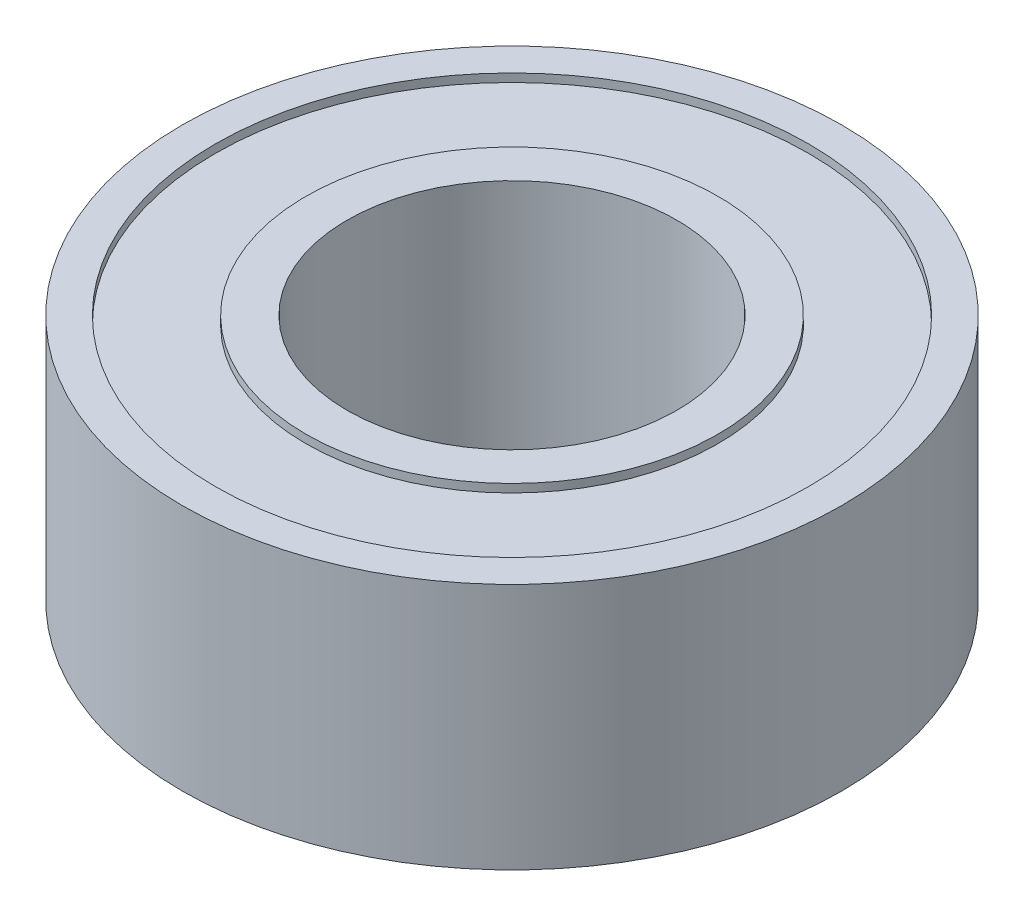
ISO-10303-21;
HEADER;
FILE_DESCRIPTION(('STEP AP214'),'2;1');
FILE_NAME('part.step','',(''),(''),'','','');
FILE_SCHEMA(('AUTOMOTIVE_DESIGN { 1 0 10303 214 1 1 1 1 }'));
ENDSEC;
DATA;
#1=APPLICATION_CONTEXT('core data for automotive mechanical design processes');
#2=APPLICATION_PROTOCOL_DEFINITION('international standard','automotive_design',2000,#1);
#3=PRODUCT_CONTEXT('',#1,'mechanical');
#4=PRODUCT('Part','Part','',(#3));
#5=PRODUCT_RELATED_PRODUCT_CATEGORY('part','',(#4));
#6=PRODUCT_DEFINITION_FORMATION('','',#4);
#7=PRODUCT_DEFINITION_CONTEXT('part definition',#1,'design');
#8=PRODUCT_DEFINITION('design','',#6,#7);
#9=PRODUCT_DEFINITION_SHAPE('','',#8);
#10=(LENGTH_UNIT() NAMED_UNIT(*) SI_UNIT(.MILLI.,.METRE.));
#11=(NAMED_UNIT(*) PLANE_ANGLE_UNIT() SI_UNIT($,.RADIAN.));
#12=(NAMED_UNIT(*) SI_UNIT($,.STERADIAN.) SOLID_ANGLE_UNIT());
#13=UNCERTAINTY_MEASURE_WITH_UNIT(LENGTH_MEASURE(1.E-05),#10,'distance_accuracy_value','');
#14=(GEOMETRIC_REPRESENTATION_CONTEXT(3) GLOBAL_UNCERTAINTY_ASSIGNED_CONTEXT((#13)) GLOBAL_UNIT_ASSIGNED_CONTEXT((#10,
#11,#12)) REPRESENTATION_CONTEXT('',''));
#15=CARTESIAN_POINT('',(0.,0.,0.));
#16=DIRECTION('',(0.,0.,1.));
#17=DIRECTION('',(1.,0.,0.));
#18=AXIS2_PLACEMENT_3D('',#15,#16,#17);
#19=CARTESIAN_POINT('',(0.,0.,0.));
#20=DIRECTION('',(0.,1.,0.));
#21=DIRECTION('',(0.,0.,1.));
#22=AXIS2_PLACEMENT_3D('',#19,#20,#21);
#23=PLANE('',#22);
#24=CARTESIAN_POINT('',(0.,0.,0.));
#25=DIRECTION('',(0.,1.,0.));
#26=DIRECTION('',(0.,0.,1.));
#27=AXIS2_PLACEMENT_3D('',#24,#25,#26);
#28=CIRCLE('',#27,2.);
#29=CARTESIAN_POINT('',(0.,0.,2.));
#30=VERTEX_POINT('',#29);
#31=EDGE_CURVE('E46',#30,#30,#28,.T.);
#32=ORIENTED_EDGE('',*,*,#31,.T.);
#33=EDGE_LOOP('',(#32));
#34=FACE_BOUND('',#33,.T.);
#35=CARTESIAN_POINT('',(0.,0.,0.));
#36=DIRECTION('',(0.,-1.,0.));
#37=DIRECTION('',(0.,0.,-1.));
#38=AXIS2_PLACEMENT_3D('',#35,#36,#37);
#39=CIRCLE('',#38,2.5);
#40=CARTESIAN_POINT('',(0.,0.,-2.5));
#41=VERTEX_POINT('',#40);
#42=EDGE_CURVE('E70',#41,#41,#39,.T.);
#43=ORIENTED_EDGE('',*,*,#42,.T.);
#44=EDGE_LOOP('',(#43));
#45=FACE_BOUND('',#44,.T.);
#46=ADVANCED_FACE('F33',(#34,#45),#23,.F.);
#47=CARTESIAN_POINT('',(0.,3.,0.));
#48=DIRECTION('',(0.,1.,0.));
#49=DIRECTION('',(0.,0.,1.));
#50=AXIS2_PLACEMENT_3D('',#47,#48,#49);
#51=PLANE('',#50);
#52=CARTESIAN_POINT('',(0.,3.,0.));
#53=DIRECTION('',(0.,1.,0.));
#54=DIRECTION('',(0.,0.,1.));
#55=AXIS2_PLACEMENT_3D('',#52,#53,#54);
#56=CIRCLE('',#55,2.);
#57=CARTESIAN_POINT('',(0.,3.,2.));
#58=VERTEX_POINT('',#57);
#59=EDGE_CURVE('E44',#58,#58,#56,.T.);
#60=ORIENTED_EDGE('',*,*,#59,.F.);
#61=EDGE_LOOP('',(#60));
#62=FACE_BOUND('',#61,.T.);
#63=CARTESIAN_POINT('',(0.,3.,0.));
#64=DIRECTION('',(0.,1.,0.));
#65=DIRECTION('',(0.,0.,1.));
#66=AXIS2_PLACEMENT_3D('',#63,#64,#65);
#67=CIRCLE('',#66,2.5);
#68=CARTESIAN_POINT('',(0.,3.,2.5));
#69=VERTEX_POINT('',#68);
#70=EDGE_CURVE('E58',#69,#69,#67,.T.);
#71=ORIENTED_EDGE('',*,*,#70,.T.);
#72=EDGE_LOOP('',(#71));
#73=FACE_BOUND('',#72,.T.);
#74=ADVANCED_FACE('F108',(#62,#73),#51,.T.);
#75=CARTESIAN_POINT('',(0.,3.,0.));
#76=DIRECTION('',(0.,1.,0.));
#77=DIRECTION('',(0.,0.,1.));
#78=AXIS2_PLACEMENT_3D('',#75,#76,#77);
#79=CIRCLE('',#78,3.6);
#80=CARTESIAN_POINT('',(0.,3.,3.6));
#81=VERTEX_POINT('',#80);
#82=EDGE_CURVE('E52',#81,#81,#79,.T.);
#83=ORIENTED_EDGE('',*,*,#82,.F.);
#84=EDGE_LOOP('',(#83));
#85=FACE_BOUND('',#84,.T.);
#86=CARTESIAN_POINT('',(0.,3.,0.));
#87=DIRECTION('',(0.,1.,0.));
#88=DIRECTION('',(0.,0.,1.));
#89=AXIS2_PLACEMENT_3D('',#86,#87,#88);
#90=CIRCLE('',#89,4.);
#91=CARTESIAN_POINT('',(0.,3.,4.));
#92=VERTEX_POINT('',#91);
#93=EDGE_CURVE('E10',#92,#92,#90,.T.);
#94=ORIENTED_EDGE('',*,*,#93,.T.);
#95=EDGE_LOOP('',(#94));
#96=FACE_BOUND('',#95,.T.);
#97=ADVANCED_FACE('F95',(#85,#96),#51,.T.);
#98=CARTESIAN_POINT('',(0.,0.,0.));
#99=DIRECTION('',(0.,-1.,0.));
#100=DIRECTION('',(0.,0.,-1.));
#101=AXIS2_PLACEMENT_3D('',#98,#99,#100);
#102=CIRCLE('',#101,3.6);
#103=CARTESIAN_POINT('',(0.,0.,-3.6));
#104=VERTEX_POINT('',#103);
#105=EDGE_CURVE('E64',#104,#104,#102,.T.);
#106=ORIENTED_EDGE('',*,*,#105,.F.);
#107=EDGE_LOOP('',(#106));
#108=FACE_BOUND('',#107,.T.);
#109=CARTESIAN_POINT('',(0.,0.,0.));
#110=DIRECTION('',(0.,1.,0.));
#111=DIRECTION('',(0.,0.,1.));
#112=AXIS2_PLACEMENT_3D('',#109,#110,#111);
#113=CIRCLE('',#112,4.);
#114=CARTESIAN_POINT('',(0.,0.,4.));
#115=VERTEX_POINT('',#114);
#116=EDGE_CURVE('E37',#115,#115,#113,.T.);
#117=ORIENTED_EDGE('',*,*,#116,.F.);
#118=EDGE_LOOP('',(#117));
#119=FACE_BOUND('',#118,.T.);
#120=ADVANCED_FACE('F92',(#108,#119),#23,.F.);
#121=CARTESIAN_POINT('',(0.,3.,0.));
#122=DIRECTION('',(0.,-1.,0.));
#123=DIRECTION('',(0.,0.,-1.));
#124=AXIS2_PLACEMENT_3D('',#121,#122,#123);
#125=CYLINDRICAL_SURFACE('',#124,4.);
#126=ORIENTED_EDGE('',*,*,#93,.F.);
#127=EDGE_LOOP('',(#126));
#128=FACE_BOUND('',#127,.T.);
#129=ORIENTED_EDGE('',*,*,#116,.T.);
#130=EDGE_LOOP('',(#129));
#131=FACE_BOUND('',#130,.T.);
#132=ADVANCED_FACE('F35',(#128,#131),#125,.T.);
#133=CARTESIAN_POINT('',(0.,3.,0.));
#134=DIRECTION('',(0.,-1.,0.));
#135=DIRECTION('',(0.,0.,-1.));
#136=AXIS2_PLACEMENT_3D('',#133,#134,#135);
#137=CYLINDRICAL_SURFACE('',#136,2.);
#138=ORIENTED_EDGE('',*,*,#59,.T.);
#139=EDGE_LOOP('',(#138));
#140=FACE_BOUND('',#139,.T.);
#141=ORIENTED_EDGE('',*,*,#31,.F.);
#142=EDGE_LOOP('',(#141));
#143=FACE_BOUND('',#142,.T.);
#144=ADVANCED_FACE('F99',(#140,#143),#137,.F.);
#145=CARTESIAN_POINT('',(0.,2.9,0.));
#146=DIRECTION('',(0.,1.,0.));
#147=DIRECTION('',(0.,0.,1.));
#148=AXIS2_PLACEMENT_3D('',#145,#146,#147);
#149=CYLINDRICAL_SURFACE('',#148,3.6);
#150=CARTESIAN_POINT('',(0.,2.9,0.));
#151=DIRECTION('',(0.,1.,0.));
#152=DIRECTION('',(0.,0.,1.));
#153=AXIS2_PLACEMENT_3D('',#150,#151,#152);
#154=CIRCLE('',#153,3.6);
#155=CARTESIAN_POINT('',(0.,2.9,3.6));
#156=VERTEX_POINT('',#155);
#157=EDGE_CURVE('E49',#156,#156,#154,.T.);
#158=ORIENTED_EDGE('',*,*,#157,.F.);
#159=EDGE_LOOP('',(#158));
#160=FACE_BOUND('',#159,.T.);
#161=ORIENTED_EDGE('',*,*,#82,.T.);
#162=EDGE_LOOP('',(#161));
#163=FACE_BOUND('',#162,.T.);
#164=ADVANCED_FACE('F104',(#160,#163),#149,.F.);
#165=CARTESIAN_POINT('',(0.,2.9,0.));
#166=DIRECTION('',(0.,1.,0.));
#167=DIRECTION('',(0.,0.,1.));
#168=AXIS2_PLACEMENT_3D('',#165,#166,#167);
#169=PLANE('',#168);
#170=CARTESIAN_POINT('',(0.,2.9,0.));
#171=DIRECTION('',(0.,1.,0.));
#172=DIRECTION('',(0.,0.,1.));
#173=AXIS2_PLACEMENT_3D('',#170,#171,#172);
#174=CIRCLE('',#173,2.5);
#175=CARTESIAN_POINT('',(0.,2.9,2.5));
#176=VERTEX_POINT('',#175);
#177=EDGE_CURVE('E55',#176,#176,#174,.T.);
#178=ORIENTED_EDGE('',*,*,#177,.F.);
#179=EDGE_LOOP('',(#178));
#180=FACE_BOUND('',#179,.T.);
#181=ORIENTED_EDGE('',*,*,#157,.T.);
#182=EDGE_LOOP('',(#181));
#183=FACE_BOUND('',#182,.T.);
#184=ADVANCED_FACE('F121',(#180,#183),#169,.T.);
#185=CARTESIAN_POINT('',(0.,2.9,0.));
#186=DIRECTION('',(0.,1.,0.));
#187=DIRECTION('',(0.,0.,1.));
#188=AXIS2_PLACEMENT_3D('',#185,#186,#187);
#189=CYLINDRICAL_SURFACE('',#188,2.5);
#190=ORIENTED_EDGE('',*,*,#177,.T.);
#191=EDGE_LOOP('',(#190));
#192=FACE_BOUND('',#191,.T.);
#193=ORIENTED_EDGE('',*,*,#70,.F.);
#194=EDGE_LOOP('',(#193));
#195=FACE_BOUND('',#194,.T.);
#196=ADVANCED_FACE('F88',(#192,#195),#189,.T.);
#197=CARTESIAN_POINT('',(0.,0.1,0.));
#198=DIRECTION('',(0.,-1.,0.));
#199=DIRECTION('',(0.,0.,-1.));
#200=AXIS2_PLACEMENT_3D('',#197,#198,#199);
#201=CYLINDRICAL_SURFACE('',#200,3.6);
#202=CARTESIAN_POINT('',(0.,0.1,0.));
#203=DIRECTION('',(0.,-1.,0.));
#204=DIRECTION('',(0.,0.,-1.));
#205=AXIS2_PLACEMENT_3D('',#202,#203,#204);
#206=CIRCLE('',#205,3.6);
#207=CARTESIAN_POINT('',(0.,0.1,-3.6));
#208=VERTEX_POINT('',#207);
#209=EDGE_CURVE('E61',#208,#208,#206,.T.);
#210=ORIENTED_EDGE('',*,*,#209,.F.);
#211=EDGE_LOOP('',(#210));
#212=FACE_BOUND('',#211,.T.);
#213=ORIENTED_EDGE('',*,*,#105,.T.);
#214=EDGE_LOOP('',(#213));
#215=FACE_BOUND('',#214,.T.);
#216=ADVANCED_FACE('F82',(#212,#215),#201,.F.);
#217=CARTESIAN_POINT('',(0.,0.1,0.));
#218=DIRECTION('',(0.,-1.,0.));
#219=DIRECTION('',(0.,0.,-1.));
#220=AXIS2_PLACEMENT_3D('',#217,#218,#219);
#221=PLANE('',#220);
#222=CARTESIAN_POINT('',(0.,0.1,0.));
#223=DIRECTION('',(0.,-1.,0.));
#224=DIRECTION('',(0.,0.,-1.));
#225=AXIS2_PLACEMENT_3D('',#222,#223,#224);
#226=CIRCLE('',#225,2.5);
#227=CARTESIAN_POINT('',(0.,0.1,-2.5));
#228=VERTEX_POINT('',#227);
#229=EDGE_CURVE('E67',#228,#228,#226,.T.);
#230=ORIENTED_EDGE('',*,*,#229,.F.);
#231=EDGE_LOOP('',(#230));
#232=FACE_BOUND('',#231,.T.);
#233=ORIENTED_EDGE('',*,*,#209,.T.);
#234=EDGE_LOOP('',(#233));
#235=FACE_BOUND('',#234,.T.);
#236=ADVANCED_FACE('F79',(#232,#235),#221,.T.);
#237=CARTESIAN_POINT('',(0.,0.1,0.));
#238=DIRECTION('',(0.,-1.,0.));
#239=DIRECTION('',(0.,0.,-1.));
#240=AXIS2_PLACEMENT_3D('',#237,#238,#239);
#241=CYLINDRICAL_SURFACE('',#240,2.5);
#242=ORIENTED_EDGE('',*,*,#229,.T.);
#243=EDGE_LOOP('',(#242));
#244=FACE_BOUND('',#243,.T.);
#245=ORIENTED_EDGE('',*,*,#42,.F.);
#246=EDGE_LOOP('',(#245));
#247=FACE_BOUND('',#246,.T.);
#248=ADVANCED_FACE('F76',(#244,#247),#241,.T.);
#249=CLOSED_SHELL('',(#46,#74,#97,#120,#132,#144,#164,#184,#196,#216,#236,#248));
#250=MANIFOLD_SOLID_BREP('B2',#249);
#251=ADVANCED_BREP_SHAPE_REPRESENTATION('',(#18,#250),#14);
#252=SHAPE_DEFINITION_REPRESENTATION(#9,#251);
ENDSEC;
END-ISO-10303-21;
